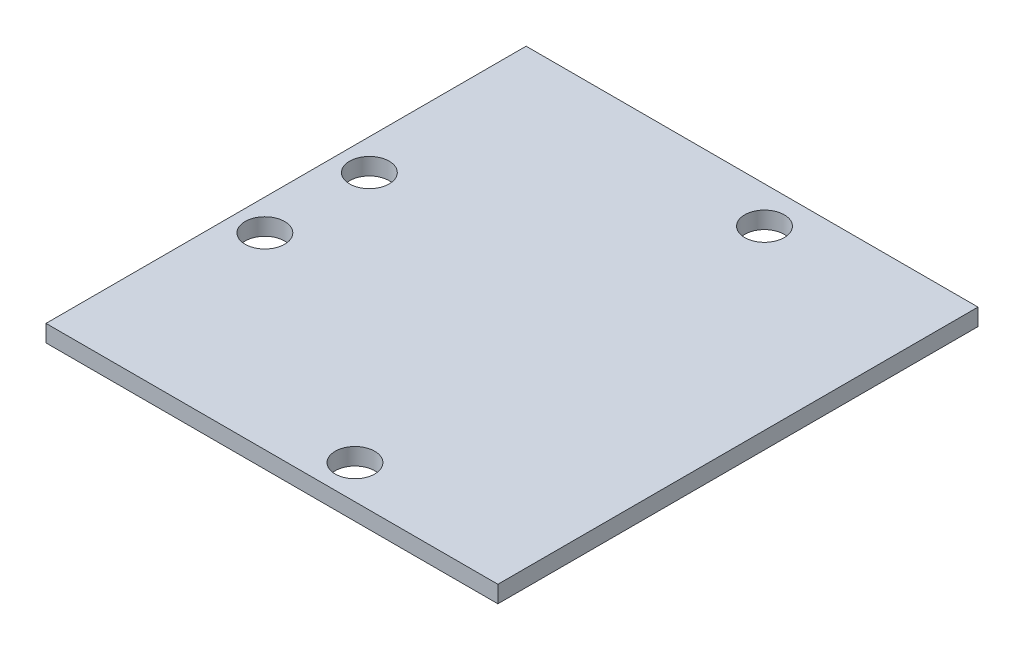
ISO-10303-21;
HEADER;
FILE_DESCRIPTION(('STEP AP214'),'2;1');
FILE_NAME('part.step','',(''),(''),'','','');
FILE_SCHEMA(('AUTOMOTIVE_DESIGN { 1 0 10303 214 1 1 1 1 }'));
ENDSEC;
DATA;
#1=APPLICATION_CONTEXT('core data for automotive mechanical design processes');
#2=APPLICATION_PROTOCOL_DEFINITION('international standard','automotive_design',2000,#1);
#3=PRODUCT_CONTEXT('',#1,'mechanical');
#4=PRODUCT('Part','Part','',(#3));
#5=PRODUCT_RELATED_PRODUCT_CATEGORY('part','',(#4));
#6=PRODUCT_DEFINITION_FORMATION('','',#4);
#7=PRODUCT_DEFINITION_CONTEXT('part definition',#1,'design');
#8=PRODUCT_DEFINITION('design','',#6,#7);
#9=PRODUCT_DEFINITION_SHAPE('','',#8);
#10=(LENGTH_UNIT() NAMED_UNIT(*) SI_UNIT(.MILLI.,.METRE.));
#11=(NAMED_UNIT(*) PLANE_ANGLE_UNIT() SI_UNIT($,.RADIAN.));
#12=(NAMED_UNIT(*) SI_UNIT($,.STERADIAN.) SOLID_ANGLE_UNIT());
#13=UNCERTAINTY_MEASURE_WITH_UNIT(LENGTH_MEASURE(1.E-05),#10,'distance_accuracy_value','');
#14=(GEOMETRIC_REPRESENTATION_CONTEXT(3) GLOBAL_UNCERTAINTY_ASSIGNED_CONTEXT((#13)) GLOBAL_UNIT_ASSIGNED_CONTEXT((#10,
#11,#12)) REPRESENTATION_CONTEXT('',''));
#15=CARTESIAN_POINT('',(0.,0.,0.));
#16=DIRECTION('',(0.,0.,1.));
#17=DIRECTION('',(1.,0.,0.));
#18=AXIS2_PLACEMENT_3D('',#15,#16,#17);
#19=CARTESIAN_POINT('',(0.,3.,0.));
#20=DIRECTION('',(1.,0.,0.));
#21=DIRECTION('',(0.,0.,-1.));
#22=AXIS2_PLACEMENT_3D('',#19,#20,#21);
#23=PLANE('',#22);
#24=DIRECTION('',(0.,0.,1.));
#25=VECTOR('',#24,1.);
#26=CARTESIAN_POINT('',(0.,0.,0.));
#27=LINE('',#26,#25);
#28=CARTESIAN_POINT('',(0.,0.,-85.));
#29=VERTEX_POINT('',#28);
#30=CARTESIAN_POINT('',(0.,0.,0.));
#31=VERTEX_POINT('',#30);
#32=EDGE_CURVE('E107',#29,#31,#27,.T.);
#33=ORIENTED_EDGE('',*,*,#32,.T.);
#34=DIRECTION('',(0.,-1.,0.));
#35=VECTOR('',#34,1.);
#36=CARTESIAN_POINT('',(0.,3.,0.));
#37=LINE('',#36,#35);
#38=CARTESIAN_POINT('',(0.,3.,0.));
#39=VERTEX_POINT('',#38);
#40=EDGE_CURVE('E11',#39,#31,#37,.T.);
#41=ORIENTED_EDGE('',*,*,#40,.F.);
#42=DIRECTION('',(0.,0.,1.));
#43=VECTOR('',#42,1.);
#44=CARTESIAN_POINT('',(0.,3.,0.));
#45=LINE('',#44,#43);
#46=CARTESIAN_POINT('',(0.,3.,-85.));
#47=VERTEX_POINT('',#46);
#48=EDGE_CURVE('E91',#47,#39,#45,.T.);
#49=ORIENTED_EDGE('',*,*,#48,.F.);
#50=DIRECTION('',(0.,-1.,0.));
#51=VECTOR('',#50,1.);
#52=CARTESIAN_POINT('',(0.,3.,-85.));
#53=LINE('',#52,#51);
#54=EDGE_CURVE('E103',#47,#29,#53,.T.);
#55=ORIENTED_EDGE('',*,*,#54,.T.);
#56=EDGE_LOOP('',(#33,#41,#49,#55));
#57=FACE_BOUND('',#56,.T.);
#58=ADVANCED_FACE('F39',(#57),#23,.F.);
#59=CARTESIAN_POINT('',(0.,3.,0.));
#60=DIRECTION('',(0.,0.,-1.));
#61=DIRECTION('',(-1.,0.,0.));
#62=AXIS2_PLACEMENT_3D('',#59,#60,#61);
#63=PLANE('',#62);
#64=DIRECTION('',(1.,0.,0.));
#65=VECTOR('',#64,1.);
#66=CARTESIAN_POINT('',(0.,0.,0.));
#67=LINE('',#66,#65);
#68=CARTESIAN_POINT('',(80.,0.,0.));
#69=VERTEX_POINT('',#68);
#70=EDGE_CURVE('E96',#31,#69,#67,.T.);
#71=ORIENTED_EDGE('',*,*,#70,.T.);
#72=DIRECTION('',(0.,-1.,0.));
#73=VECTOR('',#72,1.);
#74=CARTESIAN_POINT('',(80.,3.,0.));
#75=LINE('',#74,#73);
#76=CARTESIAN_POINT('',(80.,3.,0.));
#77=VERTEX_POINT('',#76);
#78=EDGE_CURVE('E48',#77,#69,#75,.T.);
#79=ORIENTED_EDGE('',*,*,#78,.F.);
#80=DIRECTION('',(1.,0.,0.));
#81=VECTOR('',#80,1.);
#82=CARTESIAN_POINT('',(0.,3.,0.));
#83=LINE('',#82,#81);
#84=EDGE_CURVE('E86',#39,#77,#83,.T.);
#85=ORIENTED_EDGE('',*,*,#84,.F.);
#86=ORIENTED_EDGE('',*,*,#40,.T.);
#87=EDGE_LOOP('',(#71,#79,#85,#86));
#88=FACE_BOUND('',#87,.T.);
#89=ADVANCED_FACE('F95',(#88),#63,.F.);
#90=CARTESIAN_POINT('',(80.,3.,0.));
#91=DIRECTION('',(-1.,0.,0.));
#92=DIRECTION('',(0.,0.,1.));
#93=AXIS2_PLACEMENT_3D('',#90,#91,#92);
#94=PLANE('',#93);
#95=DIRECTION('',(0.,0.,-1.));
#96=VECTOR('',#95,1.);
#97=CARTESIAN_POINT('',(80.,0.,0.));
#98=LINE('',#97,#96);
#99=CARTESIAN_POINT('',(80.,0.,-85.));
#100=VERTEX_POINT('',#99);
#101=EDGE_CURVE('E73',#69,#100,#98,.T.);
#102=ORIENTED_EDGE('',*,*,#101,.T.);
#103=DIRECTION('',(0.,-1.,0.));
#104=VECTOR('',#103,1.);
#105=CARTESIAN_POINT('',(80.,3.,-85.));
#106=LINE('',#105,#104);
#107=CARTESIAN_POINT('',(80.,3.,-85.));
#108=VERTEX_POINT('',#107);
#109=EDGE_CURVE('E98',#108,#100,#106,.T.);
#110=ORIENTED_EDGE('',*,*,#109,.F.);
#111=DIRECTION('',(0.,0.,-1.));
#112=VECTOR('',#111,1.);
#113=CARTESIAN_POINT('',(80.,3.,0.));
#114=LINE('',#113,#112);
#115=EDGE_CURVE('E89',#77,#108,#114,.T.);
#116=ORIENTED_EDGE('',*,*,#115,.F.);
#117=ORIENTED_EDGE('',*,*,#78,.T.);
#118=EDGE_LOOP('',(#102,#110,#116,#117));
#119=FACE_BOUND('',#118,.T.);
#120=ADVANCED_FACE('F99',(#119),#94,.F.);
#121=CARTESIAN_POINT('',(0.,3.,-85.));
#122=DIRECTION('',(0.,0.,1.));
#123=DIRECTION('',(1.,0.,0.));
#124=AXIS2_PLACEMENT_3D('',#121,#122,#123);
#125=PLANE('',#124);
#126=DIRECTION('',(-1.,0.,0.));
#127=VECTOR('',#126,1.);
#128=CARTESIAN_POINT('',(0.,0.,-85.));
#129=LINE('',#128,#127);
#130=EDGE_CURVE('E79',#100,#29,#129,.T.);
#131=ORIENTED_EDGE('',*,*,#130,.T.);
#132=ORIENTED_EDGE('',*,*,#54,.F.);
#133=DIRECTION('',(-1.,0.,0.));
#134=VECTOR('',#133,1.);
#135=CARTESIAN_POINT('',(0.,3.,-85.));
#136=LINE('',#135,#134);
#137=EDGE_CURVE('E56',#108,#47,#136,.T.);
#138=ORIENTED_EDGE('',*,*,#137,.F.);
#139=ORIENTED_EDGE('',*,*,#109,.T.);
#140=EDGE_LOOP('',(#131,#132,#138,#139));
#141=FACE_BOUND('',#140,.T.);
#142=ADVANCED_FACE('F121',(#141),#125,.F.);
#143=CARTESIAN_POINT('',(0.,3.,0.));
#144=DIRECTION('',(0.,-1.,0.));
#145=DIRECTION('',(0.,0.,-1.));
#146=AXIS2_PLACEMENT_3D('',#143,#144,#145);
#147=PLANE('',#146);
#148=CARTESIAN_POINT('',(48.7,3.,-6.00000000000001));
#149=DIRECTION('',(0.,1.,0.));
#150=DIRECTION('',(0.,0.,1.));
#151=AXIS2_PLACEMENT_3D('',#148,#149,#150);
#152=CIRCLE('',#151,3.5);
#153=CARTESIAN_POINT('',(48.7,3.,-2.50000000000001));
#154=VERTEX_POINT('',#153);
#155=EDGE_CURVE('E136',#154,#154,#152,.T.);
#156=ORIENTED_EDGE('',*,*,#155,.F.);
#157=EDGE_LOOP('',(#156));
#158=FACE_BOUND('',#157,.T.);
#159=CARTESIAN_POINT('',(48.7,3.,-78.5));
#160=DIRECTION('',(0.,1.,0.));
#161=DIRECTION('',(0.,0.,1.));
#162=AXIS2_PLACEMENT_3D('',#159,#160,#161);
#163=CIRCLE('',#162,3.50000000000001);
#164=CARTESIAN_POINT('',(48.7,3.,-75.));
#165=VERTEX_POINT('',#164);
#166=EDGE_CURVE('E144',#165,#165,#163,.T.);
#167=ORIENTED_EDGE('',*,*,#166,.F.);
#168=EDGE_LOOP('',(#167));
#169=FACE_BOUND('',#168,.T.);
#170=CARTESIAN_POINT('',(5.5,3.,-51.75));
#171=DIRECTION('',(0.,1.,0.));
#172=DIRECTION('',(0.,0.,1.));
#173=AXIS2_PLACEMENT_3D('',#170,#171,#172);
#174=CIRCLE('',#173,3.50000000000001);
#175=CARTESIAN_POINT('',(5.5,3.,-48.25));
#176=VERTEX_POINT('',#175);
#177=EDGE_CURVE('E152',#176,#176,#174,.T.);
#178=ORIENTED_EDGE('',*,*,#177,.F.);
#179=EDGE_LOOP('',(#178));
#180=FACE_BOUND('',#179,.T.);
#181=CARTESIAN_POINT('',(5.5,3.,-33.25));
#182=DIRECTION('',(0.,1.,0.));
#183=DIRECTION('',(0.,0.,1.));
#184=AXIS2_PLACEMENT_3D('',#181,#182,#183);
#185=CIRCLE('',#184,3.5);
#186=CARTESIAN_POINT('',(5.5,3.,-29.75));
#187=VERTEX_POINT('',#186);
#188=EDGE_CURVE('E128',#187,#187,#185,.T.);
#189=ORIENTED_EDGE('',*,*,#188,.F.);
#190=EDGE_LOOP('',(#189));
#191=FACE_BOUND('',#190,.T.);
#192=ORIENTED_EDGE('',*,*,#48,.T.);
#193=ORIENTED_EDGE('',*,*,#84,.T.);
#194=ORIENTED_EDGE('',*,*,#115,.T.);
#195=ORIENTED_EDGE('',*,*,#137,.T.);
#196=EDGE_LOOP('',(#192,#193,#194,#195));
#197=FACE_BOUND('',#196,.T.);
#198=ADVANCED_FACE('F87',(#158,#169,#180,#191,#197),#147,.F.);
#199=CARTESIAN_POINT('',(0.,0.,0.));
#200=DIRECTION('',(0.,-1.,0.));
#201=DIRECTION('',(0.,0.,-1.));
#202=AXIS2_PLACEMENT_3D('',#199,#200,#201);
#203=PLANE('',#202);
#204=CARTESIAN_POINT('',(48.7,0.,-6.00000000000001));
#205=DIRECTION('',(0.,1.,0.));
#206=DIRECTION('',(0.,0.,1.));
#207=AXIS2_PLACEMENT_3D('',#204,#205,#206);
#208=CIRCLE('',#207,3.5);
#209=CARTESIAN_POINT('',(48.7,0.,-2.50000000000001));
#210=VERTEX_POINT('',#209);
#211=EDGE_CURVE('E140',#210,#210,#208,.T.);
#212=ORIENTED_EDGE('',*,*,#211,.T.);
#213=EDGE_LOOP('',(#212));
#214=FACE_BOUND('',#213,.T.);
#215=CARTESIAN_POINT('',(48.7,0.,-78.5));
#216=DIRECTION('',(0.,1.,0.));
#217=DIRECTION('',(0.,0.,1.));
#218=AXIS2_PLACEMENT_3D('',#215,#216,#217);
#219=CIRCLE('',#218,3.50000000000001);
#220=CARTESIAN_POINT('',(48.7,0.,-75.));
#221=VERTEX_POINT('',#220);
#222=EDGE_CURVE('E148',#221,#221,#219,.T.);
#223=ORIENTED_EDGE('',*,*,#222,.T.);
#224=EDGE_LOOP('',(#223));
#225=FACE_BOUND('',#224,.T.);
#226=CARTESIAN_POINT('',(5.5,0.,-51.75));
#227=DIRECTION('',(0.,1.,0.));
#228=DIRECTION('',(0.,0.,1.));
#229=AXIS2_PLACEMENT_3D('',#226,#227,#228);
#230=CIRCLE('',#229,3.50000000000001);
#231=CARTESIAN_POINT('',(5.5,0.,-48.25));
#232=VERTEX_POINT('',#231);
#233=EDGE_CURVE('E132',#232,#232,#230,.T.);
#234=ORIENTED_EDGE('',*,*,#233,.T.);
#235=EDGE_LOOP('',(#234));
#236=FACE_BOUND('',#235,.T.);
#237=CARTESIAN_POINT('',(5.5,0.,-33.25));
#238=DIRECTION('',(0.,1.,0.));
#239=DIRECTION('',(0.,0.,1.));
#240=AXIS2_PLACEMENT_3D('',#237,#238,#239);
#241=CIRCLE('',#240,3.5);
#242=CARTESIAN_POINT('',(5.5,0.,-29.75));
#243=VERTEX_POINT('',#242);
#244=EDGE_CURVE('E111',#243,#243,#241,.T.);
#245=ORIENTED_EDGE('',*,*,#244,.T.);
#246=EDGE_LOOP('',(#245));
#247=FACE_BOUND('',#246,.T.);
#248=ORIENTED_EDGE('',*,*,#32,.F.);
#249=ORIENTED_EDGE('',*,*,#130,.F.);
#250=ORIENTED_EDGE('',*,*,#101,.F.);
#251=ORIENTED_EDGE('',*,*,#70,.F.);
#252=EDGE_LOOP('',(#248,#249,#250,#251));
#253=FACE_BOUND('',#252,.T.);
#254=ADVANCED_FACE('F124',(#214,#225,#236,#247,#253),#203,.T.);
#255=CARTESIAN_POINT('',(5.5,0.,-33.25));
#256=DIRECTION('',(0.,1.,0.));
#257=DIRECTION('',(0.,0.,1.));
#258=AXIS2_PLACEMENT_3D('',#255,#256,#257);
#259=CYLINDRICAL_SURFACE('',#258,3.5);
#260=ORIENTED_EDGE('',*,*,#244,.F.);
#261=EDGE_LOOP('',(#260));
#262=FACE_BOUND('',#261,.T.);
#263=ORIENTED_EDGE('',*,*,#188,.T.);
#264=EDGE_LOOP('',(#263));
#265=FACE_BOUND('',#264,.T.);
#266=ADVANCED_FACE('F166',(#262,#265),#259,.F.);
#267=CARTESIAN_POINT('',(5.5,0.,-51.75));
#268=DIRECTION('',(0.,1.,0.));
#269=DIRECTION('',(0.,0.,1.));
#270=AXIS2_PLACEMENT_3D('',#267,#268,#269);
#271=CYLINDRICAL_SURFACE('',#270,3.50000000000001);
#272=ORIENTED_EDGE('',*,*,#233,.F.);
#273=EDGE_LOOP('',(#272));
#274=FACE_BOUND('',#273,.T.);
#275=ORIENTED_EDGE('',*,*,#177,.T.);
#276=EDGE_LOOP('',(#275));
#277=FACE_BOUND('',#276,.T.);
#278=ADVANCED_FACE('F162',(#274,#277),#271,.F.);
#279=CARTESIAN_POINT('',(48.7,0.,-78.5));
#280=DIRECTION('',(0.,1.,0.));
#281=DIRECTION('',(0.,0.,1.));
#282=AXIS2_PLACEMENT_3D('',#279,#280,#281);
#283=CYLINDRICAL_SURFACE('',#282,3.50000000000001);
#284=ORIENTED_EDGE('',*,*,#222,.F.);
#285=EDGE_LOOP('',(#284));
#286=FACE_BOUND('',#285,.T.);
#287=ORIENTED_EDGE('',*,*,#166,.T.);
#288=EDGE_LOOP('',(#287));
#289=FACE_BOUND('',#288,.T.);
#290=ADVANCED_FACE('F165',(#286,#289),#283,.F.);
#291=CARTESIAN_POINT('',(48.7,0.,-6.00000000000001));
#292=DIRECTION('',(0.,1.,0.));
#293=DIRECTION('',(0.,0.,1.));
#294=AXIS2_PLACEMENT_3D('',#291,#292,#293);
#295=CYLINDRICAL_SURFACE('',#294,3.5);
#296=ORIENTED_EDGE('',*,*,#211,.F.);
#297=EDGE_LOOP('',(#296));
#298=FACE_BOUND('',#297,.T.);
#299=ORIENTED_EDGE('',*,*,#155,.T.);
#300=EDGE_LOOP('',(#299));
#301=FACE_BOUND('',#300,.T.);
#302=ADVANCED_FACE('F227',(#298,#301),#295,.F.);
#303=CLOSED_SHELL('',(#58,#89,#120,#142,#198,#254,#266,#278,#290,#302));
#304=MANIFOLD_SOLID_BREP('B2',#303);
#305=ADVANCED_BREP_SHAPE_REPRESENTATION('',(#18,#304),#14);
#306=SHAPE_DEFINITION_REPRESENTATION(#9,#305);
ENDSEC;
END-ISO-10303-21;
